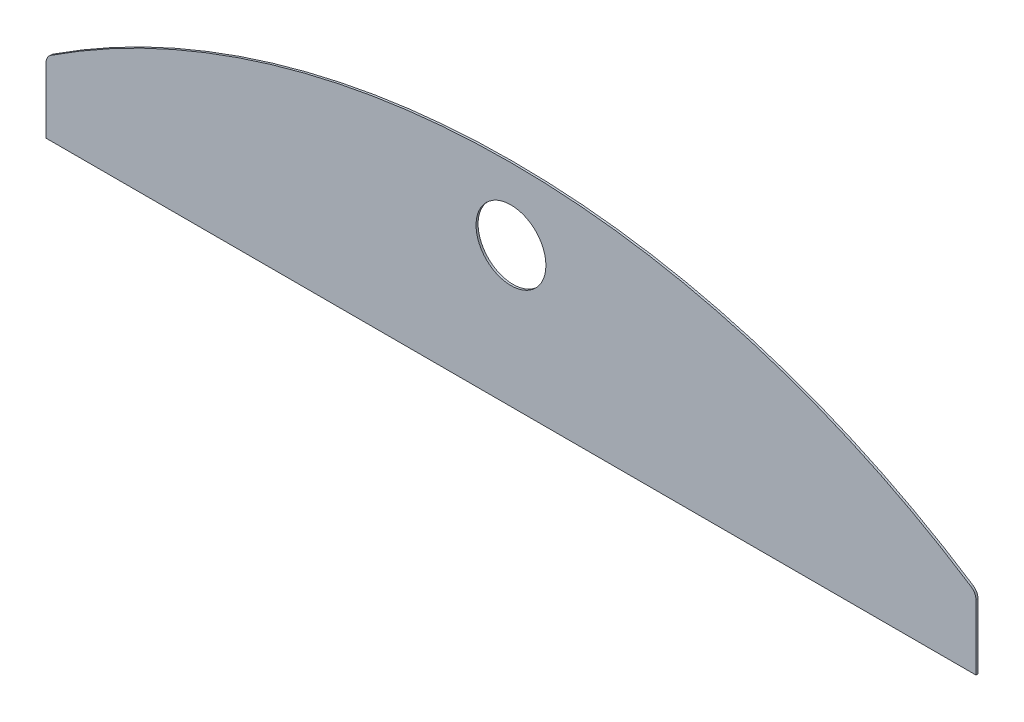
ISO-10303-21;
HEADER;
FILE_DESCRIPTION(('STEP AP214'),'2;1');
FILE_NAME('part.step','',(''),(''),'','','');
FILE_SCHEMA(('AUTOMOTIVE_DESIGN { 1 0 10303 214 1 1 1 1 }'));
ENDSEC;
DATA;
#1=APPLICATION_CONTEXT('core data for automotive mechanical design processes');
#2=APPLICATION_PROTOCOL_DEFINITION('international standard','automotive_design',2000,#1);
#3=PRODUCT_CONTEXT('',#1,'mechanical');
#4=PRODUCT('Part','Part','',(#3));
#5=PRODUCT_RELATED_PRODUCT_CATEGORY('part','',(#4));
#6=PRODUCT_DEFINITION_FORMATION('','',#4);
#7=PRODUCT_DEFINITION_CONTEXT('part definition',#1,'design');
#8=PRODUCT_DEFINITION('design','',#6,#7);
#9=PRODUCT_DEFINITION_SHAPE('','',#8);
#10=(LENGTH_UNIT() NAMED_UNIT(*) SI_UNIT(.MILLI.,.METRE.));
#11=(NAMED_UNIT(*) PLANE_ANGLE_UNIT() SI_UNIT($,.RADIAN.));
#12=(NAMED_UNIT(*) SI_UNIT($,.STERADIAN.) SOLID_ANGLE_UNIT());
#13=UNCERTAINTY_MEASURE_WITH_UNIT(LENGTH_MEASURE(1.E-05),#10,'distance_accuracy_value','');
#14=(GEOMETRIC_REPRESENTATION_CONTEXT(3) GLOBAL_UNCERTAINTY_ASSIGNED_CONTEXT((#13)) GLOBAL_UNIT_ASSIGNED_CONTEXT((#10,
#11,#12)) REPRESENTATION_CONTEXT('',''));
#15=CARTESIAN_POINT('',(0.,0.,0.));
#16=DIRECTION('',(0.,0.,1.));
#17=DIRECTION('',(1.,0.,0.));
#18=AXIS2_PLACEMENT_3D('',#15,#16,#17);
#19=CARTESIAN_POINT('',(330.2,1077.34498137761,1.5));
#20=DIRECTION('',(0.,0.,-1.));
#21=DIRECTION('',(-1.,0.,0.));
#22=AXIS2_PLACEMENT_3D('',#19,#20,#21);
#23=CYLINDRICAL_SURFACE('',#22,7.85000000000002);
#24=CARTESIAN_POINT('',(330.2,1077.34498137761,0.));
#25=DIRECTION('',(0.,0.,1.));
#26=DIRECTION('',(1.,0.,0.));
#27=AXIS2_PLACEMENT_3D('',#24,#25,#26);
#28=CIRCLE('',#27,7.85000000000002);
#29=CARTESIAN_POINT('',(338.05,1077.34498137761,0.));
#30=VERTEX_POINT('',#29);
#31=CARTESIAN_POINT('',(334.496842105263,1083.91458166396,0.));
#32=VERTEX_POINT('',#31);
#33=EDGE_CURVE('E117',#30,#32,#28,.T.);
#34=ORIENTED_EDGE('',*,*,#33,.T.);
#35=DIRECTION('',(0.,0.,-1.));
#36=VECTOR('',#35,1.);
#37=CARTESIAN_POINT('',(334.496842105263,1083.91458166396,1.5));
#38=LINE('',#37,#36);
#39=CARTESIAN_POINT('',(334.496842105263,1083.91458166396,1.5));
#40=VERTEX_POINT('',#39);
#41=EDGE_CURVE('E11',#40,#32,#38,.T.);
#42=ORIENTED_EDGE('',*,*,#41,.F.);
#43=CARTESIAN_POINT('',(330.2,1077.34498137761,1.5));
#44=DIRECTION('',(0.,0.,1.));
#45=DIRECTION('',(1.,0.,0.));
#46=AXIS2_PLACEMENT_3D('',#43,#44,#45);
#47=CIRCLE('',#46,7.85000000000002);
#48=CARTESIAN_POINT('',(338.05,1077.34498137761,1.5));
#49=VERTEX_POINT('',#48);
#50=EDGE_CURVE('E128',#49,#40,#47,.T.);
#51=ORIENTED_EDGE('',*,*,#50,.F.);
#52=DIRECTION('',(0.,0.,-1.));
#53=VECTOR('',#52,1.);
#54=CARTESIAN_POINT('',(338.05,1077.34498137761,1.5));
#55=LINE('',#54,#53);
#56=EDGE_CURVE('E113',#49,#30,#55,.T.);
#57=ORIENTED_EDGE('',*,*,#56,.T.);
#58=EDGE_LOOP('',(#34,#42,#51,#57));
#59=FACE_BOUND('',#58,.T.);
#60=ADVANCED_FACE('F33',(#59),#23,.T.);
#61=CARTESIAN_POINT('',(-6.24527556405963E-13,572.490029435968,1.5));
#62=DIRECTION('',(0.,0.,-1.));
#63=DIRECTION('',(-1.,0.,0.));
#64=AXIS2_PLACEMENT_3D('',#61,#62,#63);
#65=CYLINDRICAL_SURFACE('',#64,611.099999999998);
#66=CARTESIAN_POINT('',(-6.24527556405963E-13,572.490029435968,0.));
#67=DIRECTION('',(0.,0.,1.));
#68=DIRECTION('',(1.,0.,0.));
#69=AXIS2_PLACEMENT_3D('',#66,#67,#68);
#70=CIRCLE('',#69,611.099999999998);
#71=CARTESIAN_POINT('',(-334.496842105263,1083.91458166396,0.));
#72=VERTEX_POINT('',#71);
#73=EDGE_CURVE('E120',#32,#72,#70,.T.);
#74=ORIENTED_EDGE('',*,*,#73,.T.);
#75=DIRECTION('',(0.,0.,-1.));
#76=VECTOR('',#75,1.);
#77=CARTESIAN_POINT('',(-334.496842105263,1083.91458166396,1.5));
#78=LINE('',#77,#76);
#79=CARTESIAN_POINT('',(-334.496842105263,1083.91458166396,1.5));
#80=VERTEX_POINT('',#79);
#81=EDGE_CURVE('E41',#80,#72,#78,.T.);
#82=ORIENTED_EDGE('',*,*,#81,.F.);
#83=CARTESIAN_POINT('',(-6.24527556405963E-13,572.490029435968,1.5));
#84=DIRECTION('',(0.,0.,1.));
#85=DIRECTION('',(1.,0.,0.));
#86=AXIS2_PLACEMENT_3D('',#83,#84,#85);
#87=CIRCLE('',#86,611.099999999998);
#88=EDGE_CURVE('E86',#40,#80,#87,.T.);
#89=ORIENTED_EDGE('',*,*,#88,.F.);
#90=ORIENTED_EDGE('',*,*,#41,.T.);
#91=EDGE_LOOP('',(#74,#82,#89,#90));
#92=FACE_BOUND('',#91,.T.);
#93=ADVANCED_FACE('F153',(#92),#65,.T.);
#94=CARTESIAN_POINT('',(-330.2,1077.34498137761,1.5));
#95=DIRECTION('',(0.,0.,-1.));
#96=DIRECTION('',(-1.,0.,0.));
#97=AXIS2_PLACEMENT_3D('',#94,#95,#96);
#98=CYLINDRICAL_SURFACE('',#97,7.85000000000002);
#99=CARTESIAN_POINT('',(-330.2,1077.34498137761,0.));
#100=DIRECTION('',(0.,0.,1.));
#101=DIRECTION('',(1.,0.,0.));
#102=AXIS2_PLACEMENT_3D('',#99,#100,#101);
#103=CIRCLE('',#102,7.85000000000002);
#104=CARTESIAN_POINT('',(-338.05,1077.34498137761,0.));
#105=VERTEX_POINT('',#104);
#106=EDGE_CURVE('E123',#72,#105,#103,.T.);
#107=ORIENTED_EDGE('',*,*,#106,.T.);
#108=DIRECTION('',(0.,0.,-1.));
#109=VECTOR('',#108,1.);
#110=CARTESIAN_POINT('',(-338.05,1077.34498137761,1.5));
#111=LINE('',#110,#109);
#112=CARTESIAN_POINT('',(-338.05,1077.34498137761,1.5));
#113=VERTEX_POINT('',#112);
#114=EDGE_CURVE('E108',#113,#105,#111,.T.);
#115=ORIENTED_EDGE('',*,*,#114,.F.);
#116=CARTESIAN_POINT('',(-330.2,1077.34498137761,1.5));
#117=DIRECTION('',(0.,0.,1.));
#118=DIRECTION('',(1.,0.,0.));
#119=AXIS2_PLACEMENT_3D('',#116,#117,#118);
#120=CIRCLE('',#119,7.85000000000002);
#121=EDGE_CURVE('E99',#80,#113,#120,.T.);
#122=ORIENTED_EDGE('',*,*,#121,.F.);
#123=ORIENTED_EDGE('',*,*,#81,.T.);
#124=EDGE_LOOP('',(#107,#115,#122,#123));
#125=FACE_BOUND('',#124,.T.);
#126=ADVANCED_FACE('F134',(#125),#98,.T.);
#127=CARTESIAN_POINT('',(-338.05,1029.96776601313,1.5));
#128=DIRECTION('',(1.,0.,0.));
#129=DIRECTION('',(0.,1.,0.));
#130=AXIS2_PLACEMENT_3D('',#127,#128,#129);
#131=PLANE('',#130);
#132=DIRECTION('',(0.,-1.,0.));
#133=VECTOR('',#132,1.);
#134=CARTESIAN_POINT('',(-338.05,1029.96776601313,0.));
#135=LINE('',#134,#133);
#136=CARTESIAN_POINT('',(-338.05,1029.96776601313,0.));
#137=VERTEX_POINT('',#136);
#138=EDGE_CURVE('E107',#105,#137,#135,.T.);
#139=ORIENTED_EDGE('',*,*,#138,.T.);
#140=DIRECTION('',(0.,0.,-1.));
#141=VECTOR('',#140,1.);
#142=CARTESIAN_POINT('',(-338.05,1029.96776601313,1.5));
#143=LINE('',#142,#141);
#144=CARTESIAN_POINT('',(-338.05,1029.96776601313,1.5));
#145=VERTEX_POINT('',#144);
#146=EDGE_CURVE('E104',#145,#137,#143,.T.);
#147=ORIENTED_EDGE('',*,*,#146,.F.);
#148=DIRECTION('',(0.,-1.,0.));
#149=VECTOR('',#148,1.);
#150=CARTESIAN_POINT('',(-338.05,1029.96776601313,1.5));
#151=LINE('',#150,#149);
#152=EDGE_CURVE('E93',#113,#145,#151,.T.);
#153=ORIENTED_EDGE('',*,*,#152,.F.);
#154=ORIENTED_EDGE('',*,*,#114,.T.);
#155=EDGE_LOOP('',(#139,#147,#153,#154));
#156=FACE_BOUND('',#155,.T.);
#157=ADVANCED_FACE('F105',(#156),#131,.F.);
#158=CARTESIAN_POINT('',(338.05,1029.96776601313,1.5));
#159=DIRECTION('',(0.,1.,0.));
#160=DIRECTION('',(0.,0.,1.));
#161=AXIS2_PLACEMENT_3D('',#158,#159,#160);
#162=PLANE('',#161);
#163=DIRECTION('',(1.,0.,0.));
#164=VECTOR('',#163,1.);
#165=CARTESIAN_POINT('',(338.05,1029.96776601313,0.));
#166=LINE('',#165,#164);
#167=CARTESIAN_POINT('',(338.05,1029.96776601313,0.));
#168=VERTEX_POINT('',#167);
#169=EDGE_CURVE('E72',#137,#168,#166,.T.);
#170=ORIENTED_EDGE('',*,*,#169,.T.);
#171=DIRECTION('',(0.,0.,-1.));
#172=VECTOR('',#171,1.);
#173=CARTESIAN_POINT('',(338.05,1029.96776601313,1.5));
#174=LINE('',#173,#172);
#175=CARTESIAN_POINT('',(338.05,1029.96776601313,1.5));
#176=VERTEX_POINT('',#175);
#177=EDGE_CURVE('E109',#176,#168,#174,.T.);
#178=ORIENTED_EDGE('',*,*,#177,.F.);
#179=DIRECTION('',(1.,0.,0.));
#180=VECTOR('',#179,1.);
#181=CARTESIAN_POINT('',(338.05,1029.96776601313,1.5));
#182=LINE('',#181,#180);
#183=EDGE_CURVE('E97',#145,#176,#182,.T.);
#184=ORIENTED_EDGE('',*,*,#183,.F.);
#185=ORIENTED_EDGE('',*,*,#146,.T.);
#186=EDGE_LOOP('',(#170,#178,#184,#185));
#187=FACE_BOUND('',#186,.T.);
#188=ADVANCED_FACE('F111',(#187),#162,.F.);
#189=CARTESIAN_POINT('',(338.05,1029.96776601313,1.5));
#190=DIRECTION('',(-1.,0.,0.));
#191=DIRECTION('',(0.,-1.,0.));
#192=AXIS2_PLACEMENT_3D('',#189,#190,#191);
#193=PLANE('',#192);
#194=DIRECTION('',(0.,1.,0.));
#195=VECTOR('',#194,1.);
#196=CARTESIAN_POINT('',(338.05,1029.96776601313,0.));
#197=LINE('',#196,#195);
#198=EDGE_CURVE('E78',#168,#30,#197,.T.);
#199=ORIENTED_EDGE('',*,*,#198,.T.);
#200=ORIENTED_EDGE('',*,*,#56,.F.);
#201=DIRECTION('',(0.,1.,0.));
#202=VECTOR('',#201,1.);
#203=CARTESIAN_POINT('',(338.05,1029.96776601313,1.5));
#204=LINE('',#203,#202);
#205=EDGE_CURVE('E49',#176,#49,#204,.T.);
#206=ORIENTED_EDGE('',*,*,#205,.F.);
#207=ORIENTED_EDGE('',*,*,#177,.T.);
#208=EDGE_LOOP('',(#199,#200,#206,#207));
#209=FACE_BOUND('',#208,.T.);
#210=ADVANCED_FACE('F141',(#209),#193,.F.);
#211=CARTESIAN_POINT('',(330.2,1077.34498137761,1.5));
#212=DIRECTION('',(0.,0.,1.));
#213=DIRECTION('',(1.,0.,0.));
#214=AXIS2_PLACEMENT_3D('',#211,#212,#213);
#215=PLANE('',#214);
#216=CARTESIAN_POINT('',(0.,1131.56776601313,1.5));
#217=DIRECTION('',(0.,0.,1.));
#218=DIRECTION('',(1.,0.,0.));
#219=AXIS2_PLACEMENT_3D('',#216,#217,#218);
#220=CIRCLE('',#219,25.4);
#221=CARTESIAN_POINT('',(25.4,1131.56776601313,1.5));
#222=VERTEX_POINT('',#221);
#223=EDGE_CURVE('E208',#222,#222,#220,.T.);
#224=ORIENTED_EDGE('',*,*,#223,.F.);
#225=EDGE_LOOP('',(#224));
#226=FACE_BOUND('',#225,.T.);
#227=ORIENTED_EDGE('',*,*,#50,.T.);
#228=ORIENTED_EDGE('',*,*,#88,.T.);
#229=ORIENTED_EDGE('',*,*,#121,.T.);
#230=ORIENTED_EDGE('',*,*,#152,.T.);
#231=ORIENTED_EDGE('',*,*,#183,.T.);
#232=ORIENTED_EDGE('',*,*,#205,.T.);
#233=EDGE_LOOP('',(#227,#228,#229,#230,#231,#232));
#234=FACE_BOUND('',#233,.T.);
#235=ADVANCED_FACE('F95',(#226,#234),#215,.T.);
#236=CARTESIAN_POINT('',(330.2,1077.34498137761,0.));
#237=DIRECTION('',(0.,0.,1.));
#238=DIRECTION('',(1.,0.,0.));
#239=AXIS2_PLACEMENT_3D('',#236,#237,#238);
#240=PLANE('',#239);
#241=CARTESIAN_POINT('',(0.,1131.56776601313,0.));
#242=DIRECTION('',(0.,0.,1.));
#243=DIRECTION('',(1.,0.,0.));
#244=AXIS2_PLACEMENT_3D('',#241,#242,#243);
#245=CIRCLE('',#244,25.4);
#246=CARTESIAN_POINT('',(25.4,1131.56776601313,0.));
#247=VERTEX_POINT('',#246);
#248=EDGE_CURVE('E121',#247,#247,#245,.T.);
#249=ORIENTED_EDGE('',*,*,#248,.T.);
#250=EDGE_LOOP('',(#249));
#251=FACE_BOUND('',#250,.T.);
#252=ORIENTED_EDGE('',*,*,#33,.F.);
#253=ORIENTED_EDGE('',*,*,#198,.F.);
#254=ORIENTED_EDGE('',*,*,#169,.F.);
#255=ORIENTED_EDGE('',*,*,#138,.F.);
#256=ORIENTED_EDGE('',*,*,#106,.F.);
#257=ORIENTED_EDGE('',*,*,#73,.F.);
#258=EDGE_LOOP('',(#252,#253,#254,#255,#256,#257));
#259=FACE_BOUND('',#258,.T.);
#260=ADVANCED_FACE('F137',(#251,#259),#240,.F.);
#261=CARTESIAN_POINT('',(0.,1131.56776601313,0.));
#262=DIRECTION('',(0.,0.,1.));
#263=DIRECTION('',(1.,0.,0.));
#264=AXIS2_PLACEMENT_3D('',#261,#262,#263);
#265=CYLINDRICAL_SURFACE('',#264,25.4);
#266=ORIENTED_EDGE('',*,*,#248,.F.);
#267=EDGE_LOOP('',(#266));
#268=FACE_BOUND('',#267,.T.);
#269=ORIENTED_EDGE('',*,*,#223,.T.);
#270=EDGE_LOOP('',(#269));
#271=FACE_BOUND('',#270,.T.);
#272=ADVANCED_FACE('F190',(#268,#271),#265,.F.);
#273=CLOSED_SHELL('',(#60,#93,#126,#157,#188,#210,#235,#260,#272));
#274=MANIFOLD_SOLID_BREP('B2',#273);
#275=ADVANCED_BREP_SHAPE_REPRESENTATION('',(#18,#274),#14);
#276=SHAPE_DEFINITION_REPRESENTATION(#9,#275);
ENDSEC;
END-ISO-10303-21;
